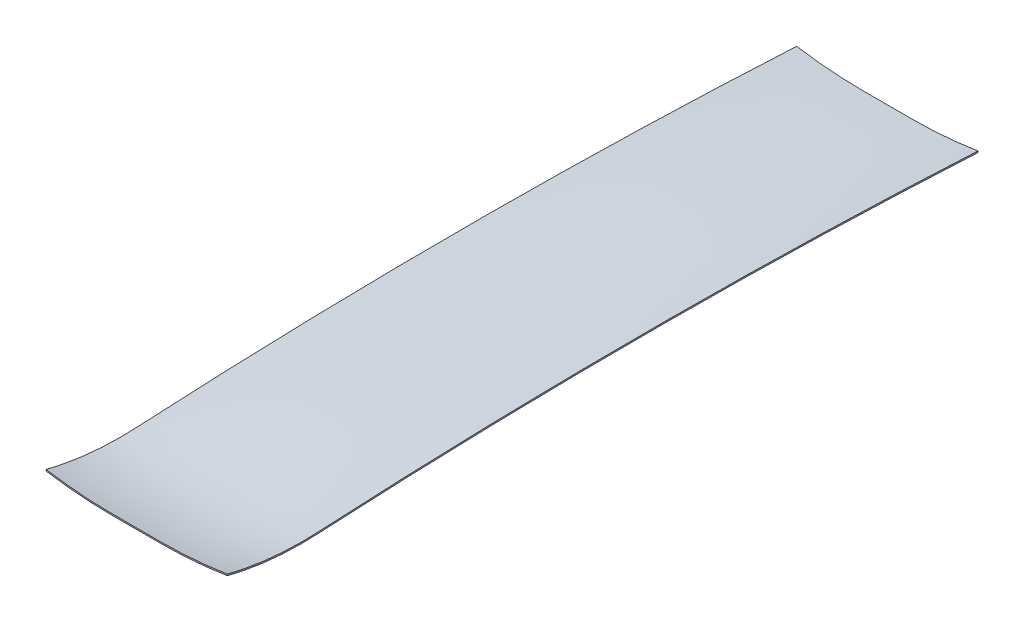
ISO-10303-21;
HEADER;
FILE_DESCRIPTION(('STEP AP214'),'2;1');
FILE_NAME('part.step','',(''),(''),'','','');
FILE_SCHEMA(('AUTOMOTIVE_DESIGN { 1 0 10303 214 1 1 1 1 }'));
ENDSEC;
DATA;
#1=APPLICATION_CONTEXT('core data for automotive mechanical design processes');
#2=APPLICATION_PROTOCOL_DEFINITION('international standard','automotive_design',2000,#1);
#3=PRODUCT_CONTEXT('',#1,'mechanical');
#4=PRODUCT('Part','Part','',(#3));
#5=PRODUCT_RELATED_PRODUCT_CATEGORY('part','',(#4));
#6=PRODUCT_DEFINITION_FORMATION('','',#4);
#7=PRODUCT_DEFINITION_CONTEXT('part definition',#1,'design');
#8=PRODUCT_DEFINITION('design','',#6,#7);
#9=PRODUCT_DEFINITION_SHAPE('','',#8);
#10=(LENGTH_UNIT() NAMED_UNIT(*) SI_UNIT(.MILLI.,.METRE.));
#11=(NAMED_UNIT(*) PLANE_ANGLE_UNIT() SI_UNIT($,.RADIAN.));
#12=(NAMED_UNIT(*) SI_UNIT($,.STERADIAN.) SOLID_ANGLE_UNIT());
#13=UNCERTAINTY_MEASURE_WITH_UNIT(LENGTH_MEASURE(1.E-05),#10,'distance_accuracy_value','');
#14=(GEOMETRIC_REPRESENTATION_CONTEXT(3) GLOBAL_UNCERTAINTY_ASSIGNED_CONTEXT((#13)) GLOBAL_UNIT_ASSIGNED_CONTEXT((#10,
#11,#12)) REPRESENTATION_CONTEXT('',''));
#15=CARTESIAN_POINT('',(0.,0.,0.));
#16=DIRECTION('',(0.,0.,1.));
#17=DIRECTION('',(1.,0.,0.));
#18=AXIS2_PLACEMENT_3D('',#15,#16,#17);
#19=CARTESIAN_POINT('',(-27.,476.763333333337,495.3));
#20=DIRECTION('',(0.,0.,-1.));
#21=DIRECTION('',(-1.,0.,0.));
#22=AXIS2_PLACEMENT_3D('',#19,#20,#21);
#23=PLANE('',#22);
#24=CARTESIAN_POINT('',(-27.,476.763333333337,495.3));
#25=DIRECTION('',(0.,0.,1.));
#26=DIRECTION('',(-1.,0.,0.));
#27=AXIS2_PLACEMENT_3D('',#24,#25,#26);
#28=CIRCLE('',#27,466.763333333336);
#29=CARTESIAN_POINT('',(-101.6,16.,495.3));
#30=VERTEX_POINT('',#29);
#31=CARTESIAN_POINT('',(-27.,10.,495.3));
#32=VERTEX_POINT('',#31);
#33=EDGE_CURVE('E562',#30,#32,#28,.T.);
#34=ORIENTED_EDGE('',*,*,#33,.T.);
#35=DIRECTION('',(1.,0.,0.));
#36=VECTOR('',#35,1.);
#37=CARTESIAN_POINT('',(-27.,10.,495.3));
#38=LINE('',#37,#36);
#39=CARTESIAN_POINT('',(26.9999999999999,10.,495.3));
#40=VERTEX_POINT('',#39);
#41=EDGE_CURVE('E13',#32,#40,#38,.T.);
#42=ORIENTED_EDGE('',*,*,#41,.T.);
#43=CARTESIAN_POINT('',(27.,476.763333333337,495.3));
#44=DIRECTION('',(0.,0.,1.));
#45=DIRECTION('',(1.,0.,0.));
#46=AXIS2_PLACEMENT_3D('',#43,#44,#45);
#47=CIRCLE('',#46,466.763333333337);
#48=CARTESIAN_POINT('',(101.6,16.,495.3));
#49=VERTEX_POINT('',#48);
#50=EDGE_CURVE('E295',#40,#49,#47,.T.);
#51=ORIENTED_EDGE('',*,*,#50,.T.);
#52=DIRECTION('',(0.,1.,0.));
#53=VECTOR('',#52,1.);
#54=CARTESIAN_POINT('',(101.6,16.,495.3));
#55=LINE('',#54,#53);
#56=CARTESIAN_POINT('',(101.6,17.5803835797035,495.3));
#57=VERTEX_POINT('',#56);
#58=EDGE_CURVE('E593',#49,#57,#55,.T.);
#59=ORIENTED_EDGE('',*,*,#58,.T.);
#60=CARTESIAN_POINT('',(27.,476.763333333337,495.3));
#61=DIRECTION('',(0.,0.,-1.));
#62=DIRECTION('',(1.,0.,0.));
#63=AXIS2_PLACEMENT_3D('',#60,#61,#62);
#64=CIRCLE('',#63,465.203333333337);
#65=CARTESIAN_POINT('',(27.,11.56,495.3));
#66=VERTEX_POINT('',#65);
#67=EDGE_CURVE('E533',#57,#66,#64,.T.);
#68=ORIENTED_EDGE('',*,*,#67,.T.);
#69=DIRECTION('',(-1.,0.,0.));
#70=VECTOR('',#69,1.);
#71=CARTESIAN_POINT('',(-27.,11.56,495.3));
#72=LINE('',#71,#70);
#73=CARTESIAN_POINT('',(-26.9999999999999,11.56,495.3));
#74=VERTEX_POINT('',#73);
#75=EDGE_CURVE('E543',#66,#74,#72,.T.);
#76=ORIENTED_EDGE('',*,*,#75,.T.);
#77=CARTESIAN_POINT('',(-27.,476.763333333337,495.3));
#78=DIRECTION('',(0.,0.,-1.));
#79=DIRECTION('',(-1.,0.,0.));
#80=AXIS2_PLACEMENT_3D('',#77,#78,#79);
#81=CIRCLE('',#80,465.203333333337);
#82=CARTESIAN_POINT('',(-101.6,17.5803835797036,495.3));
#83=VERTEX_POINT('',#82);
#84=EDGE_CURVE('E553',#74,#83,#81,.T.);
#85=ORIENTED_EDGE('',*,*,#84,.T.);
#86=DIRECTION('',(0.,-1.,0.));
#87=VECTOR('',#86,1.);
#88=CARTESIAN_POINT('',(-101.6,16.,495.3));
#89=LINE('',#88,#87);
#90=EDGE_CURVE('E461',#83,#30,#89,.T.);
#91=ORIENTED_EDGE('',*,*,#90,.T.);
#92=EDGE_LOOP('',(#34,#42,#51,#59,#68,#76,#85,#91));
#93=FACE_BOUND('',#92,.T.);
#94=ADVANCED_FACE('F284',(#93),#23,.F.);
#95=CARTESIAN_POINT('',(-27.,466.763333333336,-346.075));
#96=DIRECTION('',(0.,0.,-1.));
#97=DIRECTION('',(-1.,0.,0.));
#98=AXIS2_PLACEMENT_3D('',#95,#96,#97);
#99=PLANE('',#98);
#100=CARTESIAN_POINT('',(-27.,466.763333333336,-346.075));
#101=DIRECTION('',(0.,0.,1.));
#102=DIRECTION('',(-1.,0.,0.));
#103=AXIS2_PLACEMENT_3D('',#100,#101,#102);
#104=CIRCLE('',#103,466.763333333336);
#105=CARTESIAN_POINT('',(-101.6,6.00000000000006,-346.075));
#106=VERTEX_POINT('',#105);
#107=CARTESIAN_POINT('',(-27.,0.,-346.075));
#108=VERTEX_POINT('',#107);
#109=EDGE_CURVE('E359',#106,#108,#104,.T.);
#110=ORIENTED_EDGE('',*,*,#109,.F.);
#111=DIRECTION('',(0.,-1.,0.));
#112=VECTOR('',#111,1.);
#113=CARTESIAN_POINT('',(-101.6,5.99999999999998,-346.075));
#114=LINE('',#113,#112);
#115=CARTESIAN_POINT('',(-101.6,7.58038357970355,-346.075));
#116=VERTEX_POINT('',#115);
#117=EDGE_CURVE('E432',#116,#106,#114,.T.);
#118=ORIENTED_EDGE('',*,*,#117,.F.);
#119=CARTESIAN_POINT('',(-27.,466.763333333336,-346.075));
#120=DIRECTION('',(0.,0.,-1.));
#121=DIRECTION('',(-1.,0.,0.));
#122=AXIS2_PLACEMENT_3D('',#119,#120,#121);
#123=CIRCLE('',#122,465.203333333337);
#124=CARTESIAN_POINT('',(-26.9999999999999,1.55999999999997,-346.075));
#125=VERTEX_POINT('',#124);
#126=EDGE_CURVE('E439',#125,#116,#123,.T.);
#127=ORIENTED_EDGE('',*,*,#126,.F.);
#128=DIRECTION('',(-1.,0.,0.));
#129=VECTOR('',#128,1.);
#130=CARTESIAN_POINT('',(-27.,1.55999999999998,-346.075));
#131=LINE('',#130,#129);
#132=CARTESIAN_POINT('',(27.,1.55999999999999,-346.075));
#133=VERTEX_POINT('',#132);
#134=EDGE_CURVE('E442',#133,#125,#131,.T.);
#135=ORIENTED_EDGE('',*,*,#134,.F.);
#136=CARTESIAN_POINT('',(27.,466.763333333337,-346.075));
#137=DIRECTION('',(0.,0.,-1.));
#138=DIRECTION('',(1.,0.,0.));
#139=AXIS2_PLACEMENT_3D('',#136,#137,#138);
#140=CIRCLE('',#139,465.203333333337);
#141=CARTESIAN_POINT('',(101.6,7.58038357970353,-346.075));
#142=VERTEX_POINT('',#141);
#143=EDGE_CURVE('E724',#142,#133,#140,.T.);
#144=ORIENTED_EDGE('',*,*,#143,.F.);
#145=DIRECTION('',(0.,1.,0.));
#146=VECTOR('',#145,1.);
#147=CARTESIAN_POINT('',(101.6,5.99999999999998,-346.075));
#148=LINE('',#147,#146);
#149=CARTESIAN_POINT('',(101.6,5.99999999999998,-346.075));
#150=VERTEX_POINT('',#149);
#151=EDGE_CURVE('E370',#150,#142,#148,.T.);
#152=ORIENTED_EDGE('',*,*,#151,.F.);
#153=CARTESIAN_POINT('',(27.,466.763333333337,-346.075));
#154=DIRECTION('',(0.,0.,1.));
#155=DIRECTION('',(1.,0.,0.));
#156=AXIS2_PLACEMENT_3D('',#153,#154,#155);
#157=CIRCLE('',#156,466.763333333337);
#158=CARTESIAN_POINT('',(26.9999999999999,0.,-346.075));
#159=VERTEX_POINT('',#158);
#160=EDGE_CURVE('E354',#159,#150,#157,.T.);
#161=ORIENTED_EDGE('',*,*,#160,.F.);
#162=DIRECTION('',(1.,0.,0.));
#163=VECTOR('',#162,1.);
#164=CARTESIAN_POINT('',(-27.,0.,-346.075));
#165=LINE('',#164,#163);
#166=EDGE_CURVE('E349',#108,#159,#165,.T.);
#167=ORIENTED_EDGE('',*,*,#166,.F.);
#168=EDGE_LOOP('',(#110,#118,#127,#135,#144,#152,#161,#167));
#169=FACE_BOUND('',#168,.T.);
#170=ADVANCED_FACE('F368',(#169),#99,.T.);
#171=CARTESIAN_POINT('',(-101.6,6.00000000000006,-346.075));
#172=CARTESIAN_POINT('',(-101.6,12.2674702357254,-230.727176038867));
#173=CARTESIAN_POINT('',(-101.6,19.3973939754717,15.8738686738285));
#174=CARTESIAN_POINT('',(-101.6,13.1299237397456,262.479402620726));
#175=CARTESIAN_POINT('',(-101.6,4.14295721055266,427.877401201613));
#176=CARTESIAN_POINT('',(-101.6,7.51530808367989,462.140486072577));
#177=CARTESIAN_POINT('',(-101.6,16.0000000000001,495.3));
#178=CARTESIAN_POINT('',(-95.4368144711951,5.00214794193227,-346.075));
#179=CARTESIAN_POINT('',(-95.4368144711951,11.2696181776576,-230.727176038867));
#180=CARTESIAN_POINT('',(-95.4368144711951,18.3995419174039,15.8738686738285));
#181=CARTESIAN_POINT('',(-95.4368144711951,12.1320716816778,262.479402620726));
#182=CARTESIAN_POINT('',(-95.4368144711951,3.14510515248486,427.877401201612));
#183=CARTESIAN_POINT('',(-95.4368144711951,6.5174560256121,462.140486072576));
#184=CARTESIAN_POINT('',(-95.4368144711951,15.0021479419323,495.3));
#185=CARTESIAN_POINT('',(-83.0703968527074,3.25379063004983,-346.074999999999));
#186=CARTESIAN_POINT('',(-83.0703968527074,9.52126086577519,-230.727176038867));
#187=CARTESIAN_POINT('',(-83.0703968527073,16.6511846055214,15.8738686738283));
#188=CARTESIAN_POINT('',(-83.0703968527075,10.3837143697954,262.479402620726));
#189=CARTESIAN_POINT('',(-83.0703968527074,1.39674784060242,427.877401201612));
#190=CARTESIAN_POINT('',(-83.0703968527074,4.76909871372965,462.140486072577));
#191=CARTESIAN_POINT('',(-83.0703968527074,13.2537906300498,495.3));
#192=CARTESIAN_POINT('',(-64.4304931328823,1.37753538116441,-346.075000000001));
#193=CARTESIAN_POINT('',(-64.4304931328823,7.6450056168898,-230.727176038868));
#194=CARTESIAN_POINT('',(-64.4304931328823,14.7749293566361,15.8738686738287));
#195=CARTESIAN_POINT('',(-64.4304931328823,8.50745912090989,262.479402620727));
#196=CARTESIAN_POINT('',(-64.4304931328824,-0.47950740828299,427.877401201613));
#197=CARTESIAN_POINT('',(-64.4304931328824,2.89284346484426,462.140486072577));
#198=CARTESIAN_POINT('',(-64.4304931328823,11.3775353811645,495.3));
#199=CARTESIAN_POINT('',(-45.7303249980117,0.250567692674833,-346.074999999999));
#200=CARTESIAN_POINT('',(-45.7303249980117,6.51803792840019,-230.727176038867));
#201=CARTESIAN_POINT('',(-45.7303249980116,13.6479616681464,15.8738686738284));
#202=CARTESIAN_POINT('',(-45.7303249980117,7.38049143242037,262.479402620726));
#203=CARTESIAN_POINT('',(-45.7303249980117,-1.60647509677258,427.877401201612));
#204=CARTESIAN_POINT('',(-45.7303249980117,1.76587577635465,462.140486072577));
#205=CARTESIAN_POINT('',(-45.7303249980117,10.2505676926748,495.3));
#206=CARTESIAN_POINT('',(-33.2434417265048,0.,-346.075));
#207=CARTESIAN_POINT('',(-33.2434417265048,6.26747023572543,-230.727176038867));
#208=CARTESIAN_POINT('',(-33.2434417265048,13.3973939754717,15.8738686738285));
#209=CARTESIAN_POINT('',(-33.2434417265048,7.12992373974558,262.479402620726));
#210=CARTESIAN_POINT('',(-33.2434417265048,-1.85704278944735,427.877401201612));
#211=CARTESIAN_POINT('',(-33.2434417265048,1.51530808367989,462.140486072576));
#212=CARTESIAN_POINT('',(-33.2434417265048,10.0000000000001,495.3));
#213=CARTESIAN_POINT('',(-24.75,0.,-346.075));
#214=CARTESIAN_POINT('',(-24.75,6.26747023572537,-230.727176038867));
#215=CARTESIAN_POINT('',(-24.75,13.3973939754716,15.8738686738285));
#216=CARTESIAN_POINT('',(-24.75,7.12992373974552,262.479402620726));
#217=CARTESIAN_POINT('',(-24.75,-1.85704278944741,427.877401201612));
#218=CARTESIAN_POINT('',(-24.75,1.51530808367983,462.140486072576));
#219=CARTESIAN_POINT('',(-24.75,10.,495.3));
#220=CARTESIAN_POINT('',(-20.25,0.,-346.075000000001));
#221=CARTESIAN_POINT('',(-20.25,6.26747023572537,-230.727176038868));
#222=CARTESIAN_POINT('',(-20.25,13.3973939754716,15.873868673829));
#223=CARTESIAN_POINT('',(-20.25,7.12992373974553,262.479402620725));
#224=CARTESIAN_POINT('',(-20.25,-1.85704278944741,427.877401201613));
#225=CARTESIAN_POINT('',(-20.25,1.51530808367983,462.140486072577));
#226=CARTESIAN_POINT('',(-20.25,10.,495.300000000001));
#227=CARTESIAN_POINT('',(-13.5,0.,-346.075));
#228=CARTESIAN_POINT('',(-13.5,6.26747023572538,-230.727176038867));
#229=CARTESIAN_POINT('',(-13.5,13.3973939754716,15.873868673828));
#230=CARTESIAN_POINT('',(-13.5,7.12992373974551,262.479402620727));
#231=CARTESIAN_POINT('',(-13.5,-1.8570427894474,427.877401201613));
#232=CARTESIAN_POINT('',(-13.5,1.51530808367984,462.140486072576));
#233=CARTESIAN_POINT('',(-13.5,10.,495.299999999999));
#234=CARTESIAN_POINT('',(-6.75,0.,-346.075));
#235=CARTESIAN_POINT('',(-6.75,6.26747023572536,-230.727176038867));
#236=CARTESIAN_POINT('',(-6.75,13.3973939754716,15.8738686738289));
#237=CARTESIAN_POINT('',(-6.75,7.12992373974553,262.479402620725));
#238=CARTESIAN_POINT('',(-6.75,-1.85704278944741,427.877401201612));
#239=CARTESIAN_POINT('',(-6.75,1.51530808367983,462.140486072577));
#240=CARTESIAN_POINT('',(-6.75,10.,495.3));
#241=CARTESIAN_POINT('',(-2.25,0.,-346.075));
#242=CARTESIAN_POINT('',(-2.25,6.26747023572537,-230.727176038867));
#243=CARTESIAN_POINT('',(-2.25,13.3973939754716,15.8738686738285));
#244=CARTESIAN_POINT('',(-2.25,7.12992373974552,262.479402620726));
#245=CARTESIAN_POINT('',(-2.25,-1.85704278944741,427.877401201612));
#246=CARTESIAN_POINT('',(-2.25,1.51530808367983,462.140486072576));
#247=CARTESIAN_POINT('',(-2.25,10.,495.3));
#248=CARTESIAN_POINT('',(2.24999999999999,0.,-346.075));
#249=CARTESIAN_POINT('',(2.24999999999999,6.26747023572537,-230.727176038867));
#250=CARTESIAN_POINT('',(2.24999999999999,13.3973939754716,15.8738686738285));
#251=CARTESIAN_POINT('',(2.24999999999999,7.12992373974552,262.479402620726));
#252=CARTESIAN_POINT('',(2.24999999999999,-1.85704278944741,427.877401201612));
#253=CARTESIAN_POINT('',(2.24999999999999,1.51530808367983,462.140486072576));
#254=CARTESIAN_POINT('',(2.24999999999999,10.,495.3));
#255=CARTESIAN_POINT('',(6.74999999999997,0.,-346.075));
#256=CARTESIAN_POINT('',(6.74999999999997,6.26747023572538,-230.727176038867));
#257=CARTESIAN_POINT('',(6.74999999999997,13.3973939754716,15.8738686738289));
#258=CARTESIAN_POINT('',(6.74999999999998,7.12992373974551,262.479402620725));
#259=CARTESIAN_POINT('',(6.74999999999997,-1.8570427894474,427.877401201613));
#260=CARTESIAN_POINT('',(6.74999999999997,1.51530808367984,462.140486072577));
#261=CARTESIAN_POINT('',(6.74999999999997,10.,495.300000000001));
#262=CARTESIAN_POINT('',(13.5,0.,-346.075));
#263=CARTESIAN_POINT('',(13.5,6.26747023572537,-230.727176038868));
#264=CARTESIAN_POINT('',(13.5,13.3973939754716,15.8738686738281));
#265=CARTESIAN_POINT('',(13.5,7.12992373974552,262.479402620727));
#266=CARTESIAN_POINT('',(13.5,-1.85704278944741,427.877401201613));
#267=CARTESIAN_POINT('',(13.5,1.51530808367983,462.140486072576));
#268=CARTESIAN_POINT('',(13.5,10.,495.299999999999));
#269=CARTESIAN_POINT('',(20.2499999999999,0.,-346.075));
#270=CARTESIAN_POINT('',(20.2499999999999,6.26747023572537,-230.727176038867));
#271=CARTESIAN_POINT('',(20.2499999999999,13.3973939754716,15.8738686738289));
#272=CARTESIAN_POINT('',(20.2499999999999,7.12992373974552,262.479402620725));
#273=CARTESIAN_POINT('',(20.2499999999999,-1.8570427894474,427.877401201613));
#274=CARTESIAN_POINT('',(20.2499999999999,1.51530808367983,462.140486072577));
#275=CARTESIAN_POINT('',(20.2499999999999,10.,495.300000000001));
#276=CARTESIAN_POINT('',(24.7499999999999,0.,-346.075));
#277=CARTESIAN_POINT('',(24.7499999999999,6.26747023572537,-230.727176038867));
#278=CARTESIAN_POINT('',(24.7499999999999,13.3973939754716,15.8738686738285));
#279=CARTESIAN_POINT('',(24.7499999999999,7.12992373974552,262.479402620726));
#280=CARTESIAN_POINT('',(24.7499999999999,-1.85704278944741,427.877401201613));
#281=CARTESIAN_POINT('',(24.7499999999999,1.51530808367983,462.140486072577));
#282=CARTESIAN_POINT('',(24.7499999999999,10.,495.3));
#283=CARTESIAN_POINT('',(33.2434417265047,0.,-346.075));
#284=CARTESIAN_POINT('',(33.2434417265046,6.26747023572537,-230.727176038867));
#285=CARTESIAN_POINT('',(33.2434417265046,13.3973939754716,15.8738686738285));
#286=CARTESIAN_POINT('',(33.2434417265047,7.12992373974552,262.479402620726));
#287=CARTESIAN_POINT('',(33.2434417265047,-1.85704278944741,427.877401201613));
#288=CARTESIAN_POINT('',(33.2434417265047,1.51530808367983,462.140486072577));
#289=CARTESIAN_POINT('',(33.2434417265047,10.,495.3));
#290=CARTESIAN_POINT('',(45.7303249980117,0.250567692674772,-346.075));
#291=CARTESIAN_POINT('',(45.7303249980117,6.51803792840015,-230.727176038868));
#292=CARTESIAN_POINT('',(45.7303249980117,13.6479616681464,15.873868673828));
#293=CARTESIAN_POINT('',(45.7303249980117,7.38049143242028,262.479402620728));
#294=CARTESIAN_POINT('',(45.7303249980117,-1.60647509677263,427.877401201614));
#295=CARTESIAN_POINT('',(45.7303249980117,1.76587577635461,462.140486072578));
#296=CARTESIAN_POINT('',(45.7303249980117,10.2505676926748,495.300000000001));
#297=CARTESIAN_POINT('',(64.430493132882,1.37753538116433,-346.075));
#298=CARTESIAN_POINT('',(64.430493132882,7.64500561688969,-230.727176038867));
#299=CARTESIAN_POINT('',(64.430493132882,14.7749293566359,15.8738686738291));
#300=CARTESIAN_POINT('',(64.430493132882,8.50745912090986,262.479402620725));
#301=CARTESIAN_POINT('',(64.430493132882,-0.479507408283079,427.877401201611));
#302=CARTESIAN_POINT('',(64.430493132882,2.89284346484415,462.140486072576));
#303=CARTESIAN_POINT('',(64.430493132882,11.3775353811643,495.299999999999));
#304=CARTESIAN_POINT('',(83.0703968527073,3.25379063004974,-346.075));
#305=CARTESIAN_POINT('',(83.0703968527073,9.52126086577512,-230.727176038868));
#306=CARTESIAN_POINT('',(83.0703968527073,16.6511846055214,15.8738686738279));
#307=CARTESIAN_POINT('',(83.0703968527073,10.3837143697953,262.479402620728));
#308=CARTESIAN_POINT('',(83.0703968527073,1.39674784060234,427.877401201613));
#309=CARTESIAN_POINT('',(83.0703968527073,4.76909871372958,462.140486072577));
#310=CARTESIAN_POINT('',(83.0703968527073,13.2537906300498,495.3));
#311=CARTESIAN_POINT('',(95.4368144711949,5.00214794193216,-346.075));
#312=CARTESIAN_POINT('',(95.4368144711949,11.2696181776575,-230.727176038867));
#313=CARTESIAN_POINT('',(95.4368144711949,18.3995419174038,15.8738686738285));
#314=CARTESIAN_POINT('',(95.4368144711949,12.1320716816777,262.479402620726));
#315=CARTESIAN_POINT('',(95.4368144711949,3.14510515248475,427.877401201612));
#316=CARTESIAN_POINT('',(95.4368144711949,6.51745602561199,462.140486072576));
#317=CARTESIAN_POINT('',(95.4368144711949,15.0021479419322,495.3));
#318=CARTESIAN_POINT('',(101.6,5.99999999999998,-346.075));
#319=CARTESIAN_POINT('',(101.6,12.2674702357254,-230.727176038867));
#320=CARTESIAN_POINT('',(101.6,19.3973939754716,15.8738686738285));
#321=CARTESIAN_POINT('',(101.6,13.1299237397455,262.479402620726));
#322=CARTESIAN_POINT('',(101.6,4.14295721055258,427.877401201613));
#323=CARTESIAN_POINT('',(101.6,7.51530808367982,462.140486072577));
#324=CARTESIAN_POINT('',(101.6,16.,495.3));
#325=B_SPLINE_SURFACE_WITH_KNOTS('',3,3,((#171,#172,#173,#174,#175,#176,#177),(#178,#179,#180,
#181,#182,#183,#184),(#185,#186,#187,#188,#189,#190,#191),(#192,#193,#194,#195,#196,#197,#198),
(#199,#200,#201,#202,#203,#204,#205),(#206,#207,#208,#209,#210,#211,#212),(#213,#214,#215,#216,
#217,#218,#219),(#220,#221,#222,#223,#224,#225,#226),(#227,#228,#229,#230,#231,#232,#233),(#234,
#235,#236,#237,#238,#239,#240),(#241,#242,#243,#244,#245,#246,#247),(#248,#249,#250,#251,#252,
#253,#254),(#255,#256,#257,#258,#259,#260,#261),(#262,#263,#264,#265,#266,#267,#268),(#269,#270,
#271,#272,#273,#274,#275),(#276,#277,#278,#279,#280,#281,#282),(#283,#284,#285,#286,#287,#288,
#289),(#290,#291,#292,#293,#294,#295,#296),(#297,#298,#299,#300,#301,#302,#303),(#304,#305,#306,
#307,#308,#309,#310),(#311,#312,#313,#314,#315,#316,#317),(#318,#319,#320,#321,#322,#323,#324)),
.UNSPECIFIED.,.F.,.F.,.F.,(4,1,1,1,2,1,1,1,2,1,1,1,2,1,1,1,4),(4,1,2,4),(0.503851931936008,
0.549441100183402,0.595030268430796,0.64061943667819,0.686208604925584,0.702637945186189,
0.719067285446794,0.735496625707399,0.751925965968004,0.768355306228609,0.784784646489214,
0.801213986749819,0.817643327010424,0.863232495257818,0.908821663505212,0.954410831752606,1.),
(0.,0.410862120464388,0.878262120190609,1.),.UNSPECIFIED.);
#326=CARTESIAN_POINT('',(101.6,5.99999999999998,-346.075));
#327=CARTESIAN_POINT('',(101.6,12.2674702357254,-230.727176038867));
#328=CARTESIAN_POINT('',(101.6,19.3973939754716,15.8738686738285));
#329=CARTESIAN_POINT('',(101.6,13.1299237397455,262.479402620726));
#330=CARTESIAN_POINT('',(101.6,4.14295721055258,427.877401201613));
#331=CARTESIAN_POINT('',(101.6,7.51530808367982,462.140486072577));
#332=CARTESIAN_POINT('',(101.6,16.,495.3));
#333=B_SPLINE_CURVE_WITH_KNOTS('',3,(#326,#327,#328,#329,#330,#331,#332),.UNSPECIFIED.,.F.,.F.,
(4,1,2,4),(0.,0.410862120464388,0.878262120190609,1.),.UNSPECIFIED.);
#334=EDGE_CURVE('E465',#150,#49,#333,.T.);
#335=CARTESIAN_POINT('',(-101.6,6.00000000000006,-346.075));
#336=CARTESIAN_POINT('',(-101.6,12.2674702357254,-230.727176038867));
#337=CARTESIAN_POINT('',(-101.6,19.3973939754717,15.8738686738285));
#338=CARTESIAN_POINT('',(-101.6,13.1299237397456,262.479402620726));
#339=CARTESIAN_POINT('',(-101.6,4.14295721055266,427.877401201613));
#340=CARTESIAN_POINT('',(-101.6,7.51530808367989,462.140486072577));
#341=CARTESIAN_POINT('',(-101.6,16.0000000000001,495.3));
#342=B_SPLINE_CURVE_WITH_KNOTS('',3,(#335,#336,#337,#338,#339,#340,#341),.UNSPECIFIED.,.F.,.F.,
(4,1,2,4),(0.,0.410862120464388,0.878262120190609,1.),.UNSPECIFIED.);
#343=EDGE_CURVE('E463',#106,#30,#342,.T.);
#344=ORIENTED_EDGE('',*,*,#109,.T.);
#345=ORIENTED_EDGE('',*,*,#166,.T.);
#346=ORIENTED_EDGE('',*,*,#160,.T.);
#347=ORIENTED_EDGE('',*,*,#334,.T.);
#348=ORIENTED_EDGE('',*,*,#50,.F.);
#349=ORIENTED_EDGE('',*,*,#41,.F.);
#350=ORIENTED_EDGE('',*,*,#33,.F.);
#351=ORIENTED_EDGE('',*,*,#343,.F.);
#352=EDGE_LOOP('',(#344,#345,#346,#347,#348,#349,#350,#351));
#353=FACE_BOUND('',#352,.T.);
#354=ADVANCED_FACE('F352',(#353),#325,.T.);
#355=CARTESIAN_POINT('',(-101.6,7.58038357970355,-346.075));
#356=DIRECTION('',(-1.,0.,0.));
#357=DIRECTION('',(0.,-1.,0.));
#358=AXIS2_PLACEMENT_3D('',#355,#356,#357);
#359=PLANE('',#358);
#360=ORIENTED_EDGE('',*,*,#117,.T.);
#361=ORIENTED_EDGE('',*,*,#343,.T.);
#362=ORIENTED_EDGE('',*,*,#90,.F.);
#363=CARTESIAN_POINT('',(-101.6,7.58038357970355,-346.075));
#364=CARTESIAN_POINT('',(-101.6,13.8478538154289,-230.727176038867));
#365=CARTESIAN_POINT('',(-101.6,20.9777775551752,15.8738686738285));
#366=CARTESIAN_POINT('',(-101.6,14.7103073194491,262.479402620726));
#367=CARTESIAN_POINT('',(-101.6,5.72334079025615,427.877401201613));
#368=CARTESIAN_POINT('',(-101.6,9.09569166338338,462.140486072577));
#369=CARTESIAN_POINT('',(-101.6,17.5803835797036,495.3));
#370=B_SPLINE_CURVE_WITH_KNOTS('',3,(#363,#364,#365,#366,#367,#368,#369),.UNSPECIFIED.,.F.,.F.,
(4,1,2,4),(0.,0.410862120464388,0.878262120190609,1.),.UNSPECIFIED.);
#371=EDGE_CURVE('E452',#116,#83,#370,.T.);
#372=ORIENTED_EDGE('',*,*,#371,.F.);
#373=EDGE_LOOP('',(#360,#361,#362,#372));
#374=FACE_BOUND('',#373,.T.);
#375=ADVANCED_FACE('F458',(#374),#359,.T.);
#376=CARTESIAN_POINT('',(101.6,7.58038357970353,-346.075));
#377=CARTESIAN_POINT('',(101.6,13.8478538154289,-230.727176038867));
#378=CARTESIAN_POINT('',(101.6,20.9777775551751,15.8738686738285));
#379=CARTESIAN_POINT('',(101.6,14.7103073194491,262.479402620726));
#380=CARTESIAN_POINT('',(101.6,5.72334079025613,427.877401201613));
#381=CARTESIAN_POINT('',(101.6,9.09569166338336,462.140486072577));
#382=CARTESIAN_POINT('',(101.6,17.5803835797035,495.3));
#383=CARTESIAN_POINT('',(95.4371775246352,6.57915616716813,-346.075));
#384=CARTESIAN_POINT('',(95.4371775246351,12.8466264028935,-230.727176038867));
#385=CARTESIAN_POINT('',(95.4371775246351,19.9765501426397,15.8738686738285));
#386=CARTESIAN_POINT('',(95.4371775246352,13.7090799069137,262.479402620726));
#387=CARTESIAN_POINT('',(95.4371775246352,4.72211337772073,427.877401201613));
#388=CARTESIAN_POINT('',(95.4371775246352,8.09446425084797,462.140486072577));
#389=CARTESIAN_POINT('',(95.4371775246352,16.5791561671681,495.3));
#390=CARTESIAN_POINT('',(83.0712145984293,4.8248704103963,-346.075));
#391=CARTESIAN_POINT('',(83.0712145984293,11.0923406461217,-230.727176038867));
#392=CARTESIAN_POINT('',(83.0712145984294,18.2222643858679,15.8738686738286));
#393=CARTESIAN_POINT('',(83.0712145984293,11.9547941501418,262.479402620726));
#394=CARTESIAN_POINT('',(83.0712145984294,2.96782762094889,427.877401201613));
#395=CARTESIAN_POINT('',(83.0712145984294,6.34017849407613,462.140486072577));
#396=CARTESIAN_POINT('',(83.0712145984294,14.8248704103963,495.3));
#397=CARTESIAN_POINT('',(64.431379885113,2.94223249129963,-346.075));
#398=CARTESIAN_POINT('',(64.4313798851129,9.209702727025,-230.727176038868));
#399=CARTESIAN_POINT('',(64.4313798851129,16.3396264667712,15.8738686738285));
#400=CARTESIAN_POINT('',(64.431379885113,10.0721562310452,262.479402620727));
#401=CARTESIAN_POINT('',(64.431379885113,1.08518970185222,427.877401201613));
#402=CARTESIAN_POINT('',(64.431379885113,4.45754057497946,462.140486072576));
#403=CARTESIAN_POINT('',(64.4313798851129,12.9422324912996,495.3));
#404=CARTESIAN_POINT('',(45.7308709850361,1.81142280247993,-346.075));
#405=CARTESIAN_POINT('',(45.7308709850361,8.0788930382053,-230.727176038867));
#406=CARTESIAN_POINT('',(45.7308709850361,15.2088167779515,15.8738686738288));
#407=CARTESIAN_POINT('',(45.7308709850361,8.94134654222545,262.479402620725));
#408=CARTESIAN_POINT('',(45.7308709850361,-0.0456199869674715,427.877401201612));
#409=CARTESIAN_POINT('',(45.7308709850361,3.32673088615976,462.140486072577));
#410=CARTESIAN_POINT('',(45.7308709850361,11.8114228024799,495.3));
#411=CARTESIAN_POINT('',(33.2436237230051,1.56000000000001,-346.075));
#412=CARTESIAN_POINT('',(33.2436237230051,7.82747023572538,-230.727176038867));
#413=CARTESIAN_POINT('',(33.2436237230051,14.9573939754716,15.8738686738285));
#414=CARTESIAN_POINT('',(33.2436237230051,8.68992373974553,262.479402620726));
#415=CARTESIAN_POINT('',(33.2436237230051,-0.297042789447398,427.877401201613));
#416=CARTESIAN_POINT('',(33.2436237230051,3.07530808367984,462.140486072577));
#417=CARTESIAN_POINT('',(33.2436237230051,11.56,495.3));
#418=CARTESIAN_POINT('',(22.5,1.55999999999998,-346.075));
#419=CARTESIAN_POINT('',(22.5,7.82747023572536,-230.727176038867));
#420=CARTESIAN_POINT('',(22.5,14.9573939754716,15.8738686738285));
#421=CARTESIAN_POINT('',(22.5,8.68992373974551,262.479402620726));
#422=CARTESIAN_POINT('',(22.5,-0.297042789447421,427.877401201612));
#423=CARTESIAN_POINT('',(22.5,3.07530808367981,462.140486072576));
#424=CARTESIAN_POINT('',(22.5,11.56,495.3));
#425=CARTESIAN_POINT('',(13.5,1.55999999999999,-346.075));
#426=CARTESIAN_POINT('',(13.5,7.82747023572536,-230.727176038867));
#427=CARTESIAN_POINT('',(13.5,14.9573939754716,15.8738686738289));
#428=CARTESIAN_POINT('',(13.5,8.68992373974551,262.479402620725));
#429=CARTESIAN_POINT('',(13.5,-0.297042789447416,427.877401201613));
#430=CARTESIAN_POINT('',(13.5,3.07530808367982,462.140486072577));
#431=CARTESIAN_POINT('',(13.5,11.56,495.300000000001));
#432=CARTESIAN_POINT('',(0.,1.55999999999998,-346.075));
#433=CARTESIAN_POINT('',(0.,7.82747023572536,-230.727176038868));
#434=CARTESIAN_POINT('',(0.,14.9573939754716,15.8738686738279));
#435=CARTESIAN_POINT('',(0.,8.68992373974551,262.479402620728));
#436=CARTESIAN_POINT('',(0.,-0.297042789447423,427.877401201613));
#437=CARTESIAN_POINT('',(0.,3.07530808367981,462.140486072576));
#438=CARTESIAN_POINT('',(0.,11.56,495.299999999999));
#439=CARTESIAN_POINT('',(-13.4999999999999,1.55999999999999,-346.075));
#440=CARTESIAN_POINT('',(-13.4999999999999,7.82747023572536,-230.727176038867));
#441=CARTESIAN_POINT('',(-13.4999999999999,14.9573939754716,15.8738686738289));
#442=CARTESIAN_POINT('',(-13.4999999999999,8.6899237397455,262.479402620725));
#443=CARTESIAN_POINT('',(-13.4999999999999,-0.297042789447418,427.877401201613));
#444=CARTESIAN_POINT('',(-13.4999999999999,3.07530808367982,462.140486072577));
#445=CARTESIAN_POINT('',(-13.4999999999999,11.56,495.3));
#446=CARTESIAN_POINT('',(-22.4999999999999,1.55999999999998,-346.075));
#447=CARTESIAN_POINT('',(-22.4999999999999,7.82747023572536,-230.727176038867));
#448=CARTESIAN_POINT('',(-22.4999999999999,14.9573939754716,15.8738686738285));
#449=CARTESIAN_POINT('',(-22.4999999999999,8.68992373974551,262.479402620726));
#450=CARTESIAN_POINT('',(-22.4999999999999,-0.297042789447421,427.877401201613));
#451=CARTESIAN_POINT('',(-22.4999999999999,3.07530808367981,462.140486072577));
#452=CARTESIAN_POINT('',(-22.4999999999999,11.56,495.3));
#453=CARTESIAN_POINT('',(-33.243623723005,1.55999999999995,-346.075));
#454=CARTESIAN_POINT('',(-33.243623723005,7.82747023572532,-230.727176038867));
#455=CARTESIAN_POINT('',(-33.243623723005,14.9573939754716,15.8738686738285));
#456=CARTESIAN_POINT('',(-33.243623723005,8.68992373974547,262.479402620726));
#457=CARTESIAN_POINT('',(-33.243623723005,-0.297042789447456,427.877401201613));
#458=CARTESIAN_POINT('',(-33.243623723005,3.07530808367978,462.140486072577));
#459=CARTESIAN_POINT('',(-33.243623723005,11.56,495.3));
#460=CARTESIAN_POINT('',(-45.7308709850359,1.81142280247988,-346.075));
#461=CARTESIAN_POINT('',(-45.7308709850359,8.07889303820525,-230.727176038867));
#462=CARTESIAN_POINT('',(-45.7308709850359,15.2088167779515,15.8738686738293));
#463=CARTESIAN_POINT('',(-45.730870985036,8.9413465422254,262.479402620724));
#464=CARTESIAN_POINT('',(-45.7308709850359,-0.0456199869675253,427.877401201612));
#465=CARTESIAN_POINT('',(-45.7308709850359,3.32673088615971,462.140486072577));
#466=CARTESIAN_POINT('',(-45.7308709850359,11.8114228024799,495.300000000001));
#467=CARTESIAN_POINT('',(-64.4313798851129,2.94223249129956,-346.075000000001));
#468=CARTESIAN_POINT('',(-64.431379885113,9.20970272702493,-230.727176038868));
#469=CARTESIAN_POINT('',(-64.431379885113,16.3396264667712,15.8738686738276));
#470=CARTESIAN_POINT('',(-64.4313798851129,10.0721562310451,262.479402620729));
#471=CARTESIAN_POINT('',(-64.431379885113,1.08518970185215,427.877401201613));
#472=CARTESIAN_POINT('',(-64.431379885113,4.45754057497939,462.140486072577));
#473=CARTESIAN_POINT('',(-64.431379885113,12.9422324912996,495.299999999999));
#474=CARTESIAN_POINT('',(-83.0712145984293,4.82487041039625,-346.074999999999));
#475=CARTESIAN_POINT('',(-83.0712145984293,11.0923406461216,-230.727176038867));
#476=CARTESIAN_POINT('',(-83.0712145984291,18.2222643858679,15.8738686738292));
#477=CARTESIAN_POINT('',(-83.0712145984294,11.9547941501418,262.479402620724));
#478=CARTESIAN_POINT('',(-83.0712145984293,2.96782762094884,427.877401201612));
#479=CARTESIAN_POINT('',(-83.0712145984293,6.34017849407608,462.140486072576));
#480=CARTESIAN_POINT('',(-83.0712145984292,14.8248704103963,495.3));
#481=CARTESIAN_POINT('',(-95.4371775246351,6.57915616716808,-346.075));
#482=CARTESIAN_POINT('',(-95.4371775246351,12.8466264028934,-230.727176038867));
#483=CARTESIAN_POINT('',(-95.4371775246351,19.9765501426397,15.8738686738285));
#484=CARTESIAN_POINT('',(-95.4371775246352,13.7090799069136,262.479402620726));
#485=CARTESIAN_POINT('',(-95.4371775246352,4.72211337772067,427.877401201613));
#486=CARTESIAN_POINT('',(-95.4371775246351,8.09446425084791,462.140486072577));
#487=CARTESIAN_POINT('',(-95.4371775246351,16.5791561671681,495.3));
#488=CARTESIAN_POINT('',(-101.6,7.58038357970355,-346.075));
#489=CARTESIAN_POINT('',(-101.6,13.8478538154289,-230.727176038867));
#490=CARTESIAN_POINT('',(-101.6,20.9777775551752,15.8738686738285));
#491=CARTESIAN_POINT('',(-101.6,14.7103073194491,262.479402620726));
#492=CARTESIAN_POINT('',(-101.6,5.72334079025615,427.877401201613));
#493=CARTESIAN_POINT('',(-101.6,9.09569166338338,462.140486072577));
#494=CARTESIAN_POINT('',(-101.6,17.5803835797036,495.3));
#495=B_SPLINE_SURFACE_WITH_KNOTS('',3,3,((#376,#377,#378,#379,#380,#381,#382),(#383,#384,#385,
#386,#387,#388,#389),(#390,#391,#392,#393,#394,#395,#396),(#397,#398,#399,#400,#401,#402,#403),
(#404,#405,#406,#407,#408,#409,#410),(#411,#412,#413,#414,#415,#416,#417),(#418,#419,#420,#421,
#422,#423,#424),(#425,#426,#427,#428,#429,#430,#431),(#432,#433,#434,#435,#436,#437,#438),(#439,
#440,#441,#442,#443,#444,#445),(#446,#447,#448,#449,#450,#451,#452),(#453,#454,#455,#456,#457,
#458,#459),(#460,#461,#462,#463,#464,#465,#466),(#467,#468,#469,#470,#471,#472,#473),(#474,#475,
#476,#477,#478,#479,#480),(#481,#482,#483,#484,#485,#486,#487),(#488,#489,#490,#491,#492,#493,
#494)),.UNSPECIFIED.,.F.,.F.,.F.,(4,1,1,1,2,1,1,1,2,1,1,1,4),(4,1,2,4),(0.00384661623306995,
0.0494371134061985,0.095027610579327,0.140618107752456,0.186208604925584,0.219067285446794,
0.251925965968004,0.284784646489214,0.317643327010423,0.363233824183552,0.408824321356681,
0.454414818529809,0.500005315702938),(0.,0.410862120464388,0.878262120190609,1.),.UNSPECIFIED.);
#496=CARTESIAN_POINT('',(101.6,7.58038357970353,-346.075));
#497=CARTESIAN_POINT('',(101.6,13.8478538154289,-230.727176038867));
#498=CARTESIAN_POINT('',(101.6,20.9777775551751,15.8738686738285));
#499=CARTESIAN_POINT('',(101.6,14.7103073194491,262.479402620726));
#500=CARTESIAN_POINT('',(101.6,5.72334079025613,427.877401201613));
#501=CARTESIAN_POINT('',(101.6,9.09569166338336,462.140486072577));
#502=CARTESIAN_POINT('',(101.6,17.5803835797035,495.3));
#503=B_SPLINE_CURVE_WITH_KNOTS('',3,(#496,#497,#498,#499,#500,#501,#502),.UNSPECIFIED.,.F.,.F.,
(4,1,2,4),(0.,0.410862120464388,0.878262120190609,1.),.UNSPECIFIED.);
#504=EDGE_CURVE('E363',#142,#57,#503,.T.);
#505=ORIENTED_EDGE('',*,*,#143,.T.);
#506=ORIENTED_EDGE('',*,*,#134,.T.);
#507=ORIENTED_EDGE('',*,*,#126,.T.);
#508=ORIENTED_EDGE('',*,*,#371,.T.);
#509=ORIENTED_EDGE('',*,*,#84,.F.);
#510=ORIENTED_EDGE('',*,*,#75,.F.);
#511=ORIENTED_EDGE('',*,*,#67,.F.);
#512=ORIENTED_EDGE('',*,*,#504,.F.);
#513=EDGE_LOOP('',(#505,#506,#507,#508,#509,#510,#511,#512));
#514=FACE_BOUND('',#513,.T.);
#515=ADVANCED_FACE('F389',(#514),#495,.T.);
#516=CARTESIAN_POINT('',(101.6,5.99999999999998,-346.075));
#517=DIRECTION('',(1.,1.14156616038386E-13,0.));
#518=DIRECTION('',(-1.14156616038386E-13,1.,0.));
#519=AXIS2_PLACEMENT_3D('',#516,#517,#518);
#520=PLANE('',#519);
#521=ORIENTED_EDGE('',*,*,#151,.T.);
#522=ORIENTED_EDGE('',*,*,#504,.T.);
#523=ORIENTED_EDGE('',*,*,#58,.F.);
#524=ORIENTED_EDGE('',*,*,#334,.F.);
#525=EDGE_LOOP('',(#521,#522,#523,#524));
#526=FACE_BOUND('',#525,.T.);
#527=ADVANCED_FACE('F286',(#526),#520,.T.);
#528=CLOSED_SHELL('',(#94,#170,#354,#375,#515,#527));
#529=MANIFOLD_SOLID_BREP('B2',#528);
#530=ADVANCED_BREP_SHAPE_REPRESENTATION('',(#18,#529),#14);
#531=SHAPE_DEFINITION_REPRESENTATION(#9,#530);
ENDSEC;
END-ISO-10303-21;
